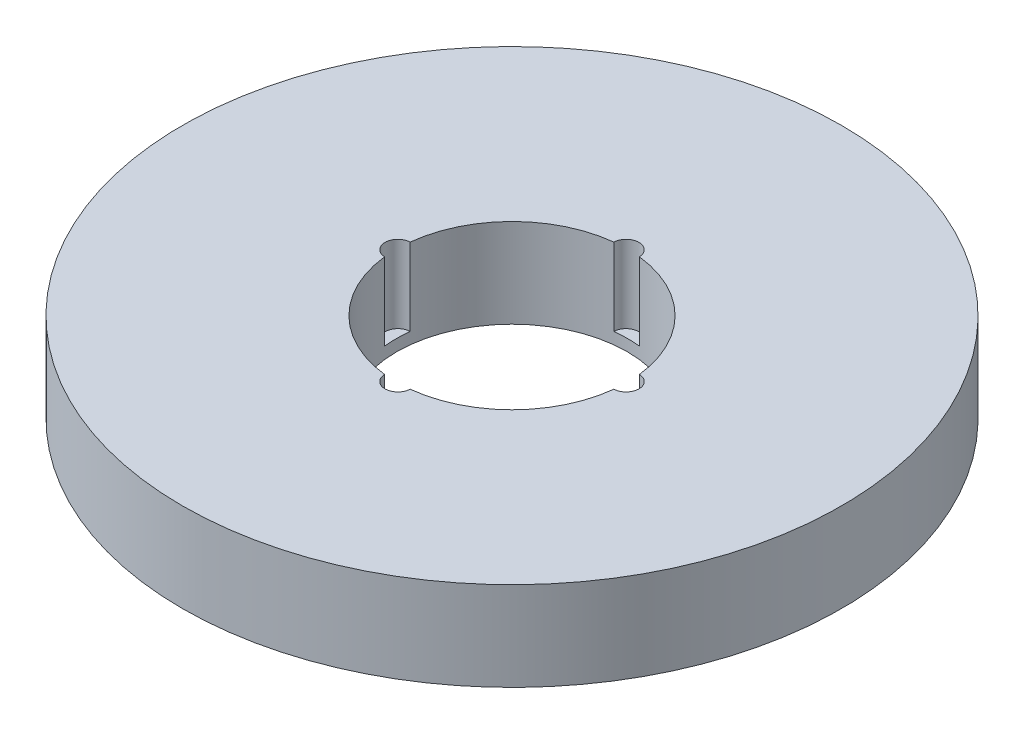
ISO-10303-21;
HEADER;
FILE_DESCRIPTION(('STEP AP214'),'2;1');
FILE_NAME('part.step','',(''),(''),'','','');
FILE_SCHEMA(('AUTOMOTIVE_DESIGN { 1 0 10303 214 1 1 1 1 }'));
ENDSEC;
DATA;
#1=APPLICATION_CONTEXT('core data for automotive mechanical design processes');
#2=APPLICATION_PROTOCOL_DEFINITION('international standard','automotive_design',2000,#1);
#3=PRODUCT_CONTEXT('',#1,'mechanical');
#4=PRODUCT('Part','Part','',(#3));
#5=PRODUCT_RELATED_PRODUCT_CATEGORY('part','',(#4));
#6=PRODUCT_DEFINITION_FORMATION('','',#4);
#7=PRODUCT_DEFINITION_CONTEXT('part definition',#1,'design');
#8=PRODUCT_DEFINITION('design','',#6,#7);
#9=PRODUCT_DEFINITION_SHAPE('','',#8);
#10=(LENGTH_UNIT() NAMED_UNIT(*) SI_UNIT(.MILLI.,.METRE.));
#11=(NAMED_UNIT(*) PLANE_ANGLE_UNIT() SI_UNIT($,.RADIAN.));
#12=(NAMED_UNIT(*) SI_UNIT($,.STERADIAN.) SOLID_ANGLE_UNIT());
#13=UNCERTAINTY_MEASURE_WITH_UNIT(LENGTH_MEASURE(1.E-05),#10,'distance_accuracy_value','');
#14=(GEOMETRIC_REPRESENTATION_CONTEXT(3) GLOBAL_UNCERTAINTY_ASSIGNED_CONTEXT((#13)) GLOBAL_UNIT_ASSIGNED_CONTEXT((#10,
#11,#12)) REPRESENTATION_CONTEXT('',''));
#15=CARTESIAN_POINT('',(0.,0.,0.));
#16=DIRECTION('',(0.,0.,1.));
#17=DIRECTION('',(1.,0.,0.));
#18=AXIS2_PLACEMENT_3D('',#15,#16,#17);
#19=CARTESIAN_POINT('',(0.,27.,0.));
#20=DIRECTION('',(0.,-1.,0.));
#21=DIRECTION('',(0.,0.,-1.));
#22=AXIS2_PLACEMENT_3D('',#19,#20,#21);
#23=CYLINDRICAL_SURFACE('',#22,100.);
#24=CARTESIAN_POINT('',(0.,27.,0.));
#25=DIRECTION('',(0.,1.,0.));
#26=DIRECTION('',(0.,0.,1.));
#27=AXIS2_PLACEMENT_3D('',#24,#25,#26);
#28=CIRCLE('',#27,100.);
#29=CARTESIAN_POINT('',(0.,27.,100.));
#30=VERTEX_POINT('',#29);
#31=EDGE_CURVE('E148',#30,#30,#28,.T.);
#32=ORIENTED_EDGE('',*,*,#31,.F.);
#33=EDGE_LOOP('',(#32));
#34=FACE_BOUND('',#33,.T.);
#35=CARTESIAN_POINT('',(0.,0.,0.));
#36=DIRECTION('',(0.,1.,0.));
#37=DIRECTION('',(0.,0.,1.));
#38=AXIS2_PLACEMENT_3D('',#35,#36,#37);
#39=CIRCLE('',#38,100.);
#40=CARTESIAN_POINT('',(0.,0.,100.));
#41=VERTEX_POINT('',#40);
#42=EDGE_CURVE('E139',#41,#41,#39,.T.);
#43=ORIENTED_EDGE('',*,*,#42,.T.);
#44=EDGE_LOOP('',(#43));
#45=FACE_BOUND('',#44,.T.);
#46=ADVANCED_FACE('F39',(#34,#45),#23,.T.);
#47=CARTESIAN_POINT('',(0.,27.,0.));
#48=DIRECTION('',(0.,1.,0.));
#49=DIRECTION('',(0.,0.,1.));
#50=AXIS2_PLACEMENT_3D('',#47,#48,#49);
#51=PLANE('',#50);
#52=CARTESIAN_POINT('',(1.20958514868444E-13,27.,34.6438955645464));
#53=DIRECTION('',(0.,1.,0.));
#54=DIRECTION('',(1.,0.,0.));
#55=AXIS2_PLACEMENT_3D('',#52,#53,#54);
#56=CIRCLE('',#55,3.8728173395284);
#57=CARTESIAN_POINT('',(-3.87023278960007,27.,34.7853603999485));
#58=VERTEX_POINT('',#57);
#59=CARTESIAN_POINT('',(3.87023278960032,27.,34.7853603999485));
#60=VERTEX_POINT('',#59);
#61=EDGE_CURVE('E175',#58,#60,#56,.T.);
#62=ORIENTED_EDGE('',*,*,#61,.F.);
#63=CARTESIAN_POINT('',(0.,27.,0.));
#64=DIRECTION('',(0.,1.,0.));
#65=DIRECTION('',(0.,0.,1.));
#66=AXIS2_PLACEMENT_3D('',#63,#64,#65);
#67=CIRCLE('',#66,35.);
#68=CARTESIAN_POINT('',(-34.7853603999485,27.,3.87023278960019));
#69=VERTEX_POINT('',#68);
#70=EDGE_CURVE('E134',#69,#58,#67,.T.);
#71=ORIENTED_EDGE('',*,*,#70,.F.);
#72=CARTESIAN_POINT('',(-34.6438955645464,27.,0.));
#73=DIRECTION('',(0.,1.,0.));
#74=DIRECTION('',(0.,0.,1.));
#75=AXIS2_PLACEMENT_3D('',#72,#73,#74);
#76=CIRCLE('',#75,3.8728173395284);
#77=CARTESIAN_POINT('',(-34.7853603999485,27.,-3.87023278960019));
#78=VERTEX_POINT('',#77);
#79=EDGE_CURVE('E143',#78,#69,#76,.T.);
#80=ORIENTED_EDGE('',*,*,#79,.F.);
#81=CARTESIAN_POINT('',(-3.87023278960056,27.,-34.7853603999484));
#82=VERTEX_POINT('',#81);
#83=EDGE_CURVE('E123',#82,#78,#67,.T.);
#84=ORIENTED_EDGE('',*,*,#83,.F.);
#85=CARTESIAN_POINT('',(-3.62875544605333E-13,27.,-34.6438955645464));
#86=DIRECTION('',(0.,1.,0.));
#87=DIRECTION('',(-1.,0.,0.));
#88=AXIS2_PLACEMENT_3D('',#85,#86,#87);
#89=CIRCLE('',#88,3.8728173395284);
#90=CARTESIAN_POINT('',(3.87023278959983,27.,-34.7853603999485));
#91=VERTEX_POINT('',#90);
#92=EDGE_CURVE('E106',#91,#82,#89,.T.);
#93=ORIENTED_EDGE('',*,*,#92,.F.);
#94=CARTESIAN_POINT('',(34.7853603999485,27.,-3.87023278960019));
#95=VERTEX_POINT('',#94);
#96=EDGE_CURVE('E125',#95,#91,#67,.T.);
#97=ORIENTED_EDGE('',*,*,#96,.F.);
#98=CARTESIAN_POINT('',(34.6438955645464,27.,0.));
#99=DIRECTION('',(0.,1.,0.));
#100=DIRECTION('',(0.,0.,-1.));
#101=AXIS2_PLACEMENT_3D('',#98,#99,#100);
#102=CIRCLE('',#101,3.8728173395284);
#103=CARTESIAN_POINT('',(34.7853603999485,27.,3.87023278960019));
#104=VERTEX_POINT('',#103);
#105=EDGE_CURVE('E286',#104,#95,#102,.T.);
#106=ORIENTED_EDGE('',*,*,#105,.F.);
#107=EDGE_CURVE('E135',#60,#104,#67,.T.);
#108=ORIENTED_EDGE('',*,*,#107,.F.);
#109=EDGE_LOOP('',(#62,#71,#80,#84,#93,#97,#106,#108));
#110=FACE_BOUND('',#109,.T.);
#111=ORIENTED_EDGE('',*,*,#31,.T.);
#112=EDGE_LOOP('',(#111));
#113=FACE_BOUND('',#112,.T.);
#114=ADVANCED_FACE('F118',(#110,#113),#51,.T.);
#115=CARTESIAN_POINT('',(0.,0.,0.));
#116=DIRECTION('',(0.,1.,0.));
#117=DIRECTION('',(0.,0.,1.));
#118=AXIS2_PLACEMENT_3D('',#115,#116,#117);
#119=PLANE('',#118);
#120=CARTESIAN_POINT('',(0.,0.,0.));
#121=DIRECTION('',(0.,1.,0.));
#122=DIRECTION('',(0.,0.,1.));
#123=AXIS2_PLACEMENT_3D('',#120,#121,#122);
#124=CIRCLE('',#123,35.);
#125=CARTESIAN_POINT('',(0.,0.,35.));
#126=VERTEX_POINT('',#125);
#127=EDGE_CURVE('E136',#126,#126,#124,.T.);
#128=ORIENTED_EDGE('',*,*,#127,.T.);
#129=EDGE_LOOP('',(#128));
#130=FACE_BOUND('',#129,.T.);
#131=ORIENTED_EDGE('',*,*,#42,.F.);
#132=EDGE_LOOP('',(#131));
#133=FACE_BOUND('',#132,.T.);
#134=ADVANCED_FACE('F187',(#130,#133),#119,.F.);
#135=CARTESIAN_POINT('',(0.,27.,0.));
#136=DIRECTION('',(0.,-1.,0.));
#137=DIRECTION('',(0.,0.,-1.));
#138=AXIS2_PLACEMENT_3D('',#135,#136,#137);
#139=CYLINDRICAL_SURFACE('',#138,35.);
#140=DIRECTION('',(0.,1.,0.));
#141=VECTOR('',#140,1.);
#142=CARTESIAN_POINT('',(-3.87023278960007,15.2589677289112,34.7853603999485));
#143=LINE('',#142,#141);
#144=CARTESIAN_POINT('',(-3.87023278960007,3.51793545782236,34.7853603999485));
#145=VERTEX_POINT('',#144);
#146=EDGE_CURVE('E11',#145,#58,#143,.T.);
#147=ORIENTED_EDGE('',*,*,#146,.F.);
#148=CARTESIAN_POINT('',(0.,3.51793545782236,0.));
#149=DIRECTION('',(0.,1.,0.));
#150=DIRECTION('',(0.,0.,1.));
#151=AXIS2_PLACEMENT_3D('',#148,#149,#150);
#152=CIRCLE('',#151,35.);
#153=CARTESIAN_POINT('',(3.87023278960032,3.51793545782236,34.7853603999485));
#154=VERTEX_POINT('',#153);
#155=EDGE_CURVE('E170',#145,#154,#152,.T.);
#156=ORIENTED_EDGE('',*,*,#155,.T.);
#157=DIRECTION('',(0.,1.,0.));
#158=VECTOR('',#157,1.);
#159=CARTESIAN_POINT('',(3.87023278960031,15.2589677289112,34.7853603999485));
#160=LINE('',#159,#158);
#161=EDGE_CURVE('E46',#60,#154,#160,.F.);
#162=ORIENTED_EDGE('',*,*,#161,.F.);
#163=ORIENTED_EDGE('',*,*,#107,.T.);
#164=DIRECTION('',(0.,1.,0.));
#165=VECTOR('',#164,1.);
#166=CARTESIAN_POINT('',(34.7853603999485,15.2589677289112,3.87023278960019));
#167=LINE('',#166,#165);
#168=CARTESIAN_POINT('',(34.7853603999485,3.51793545782236,3.87023278960019));
#169=VERTEX_POINT('',#168);
#170=EDGE_CURVE('E164',#169,#104,#167,.T.);
#171=ORIENTED_EDGE('',*,*,#170,.F.);
#172=CARTESIAN_POINT('',(0.,3.51793545782236,0.));
#173=DIRECTION('',(0.,1.,0.));
#174=DIRECTION('',(0.,0.,1.));
#175=AXIS2_PLACEMENT_3D('',#172,#173,#174);
#176=CIRCLE('',#175,35.);
#177=CARTESIAN_POINT('',(34.7853603999485,3.51793545782236,-3.87023278960019));
#178=VERTEX_POINT('',#177);
#179=EDGE_CURVE('E115',#169,#178,#176,.T.);
#180=ORIENTED_EDGE('',*,*,#179,.T.);
#181=DIRECTION('',(0.,1.,0.));
#182=VECTOR('',#181,1.);
#183=CARTESIAN_POINT('',(34.7853603999485,15.2589677289112,-3.87023278960019));
#184=LINE('',#183,#182);
#185=EDGE_CURVE('E131',#95,#178,#184,.F.);
#186=ORIENTED_EDGE('',*,*,#185,.F.);
#187=ORIENTED_EDGE('',*,*,#96,.T.);
#188=DIRECTION('',(0.,1.,0.));
#189=VECTOR('',#188,1.);
#190=CARTESIAN_POINT('',(3.87023278959983,15.2589677289112,-34.7853603999485));
#191=LINE('',#190,#189);
#192=CARTESIAN_POINT('',(3.87023278959983,3.51793545782236,-34.7853603999485));
#193=VERTEX_POINT('',#192);
#194=EDGE_CURVE('E105',#193,#91,#191,.T.);
#195=ORIENTED_EDGE('',*,*,#194,.F.);
#196=CARTESIAN_POINT('',(0.,3.51793545782236,0.));
#197=DIRECTION('',(0.,1.,0.));
#198=DIRECTION('',(0.,0.,1.));
#199=AXIS2_PLACEMENT_3D('',#196,#197,#198);
#200=CIRCLE('',#199,35.);
#201=CARTESIAN_POINT('',(-3.87023278960056,3.51793545782236,-34.7853603999484));
#202=VERTEX_POINT('',#201);
#203=EDGE_CURVE('E159',#193,#202,#200,.T.);
#204=ORIENTED_EDGE('',*,*,#203,.T.);
#205=DIRECTION('',(0.,1.,0.));
#206=VECTOR('',#205,1.);
#207=CARTESIAN_POINT('',(-3.87023278960056,15.2589677289112,-34.7853603999485));
#208=LINE('',#207,#206);
#209=EDGE_CURVE('E114',#82,#202,#208,.F.);
#210=ORIENTED_EDGE('',*,*,#209,.F.);
#211=ORIENTED_EDGE('',*,*,#83,.T.);
#212=DIRECTION('',(0.,1.,0.));
#213=VECTOR('',#212,1.);
#214=CARTESIAN_POINT('',(-34.7853603999485,15.2589677289112,-3.87023278960019));
#215=LINE('',#214,#213);
#216=CARTESIAN_POINT('',(-34.7853603999485,3.51793545782236,-3.87023278960019));
#217=VERTEX_POINT('',#216);
#218=EDGE_CURVE('E160',#217,#78,#215,.T.);
#219=ORIENTED_EDGE('',*,*,#218,.F.);
#220=CARTESIAN_POINT('',(0.,3.51793545782236,0.));
#221=DIRECTION('',(0.,1.,0.));
#222=DIRECTION('',(0.,0.,1.));
#223=AXIS2_PLACEMENT_3D('',#220,#221,#222);
#224=CIRCLE('',#223,35.);
#225=CARTESIAN_POINT('',(-34.7853603999485,3.51793545782236,3.87023278960019));
#226=VERTEX_POINT('',#225);
#227=EDGE_CURVE('E149',#217,#226,#224,.T.);
#228=ORIENTED_EDGE('',*,*,#227,.T.);
#229=DIRECTION('',(0.,1.,0.));
#230=VECTOR('',#229,1.);
#231=CARTESIAN_POINT('',(-34.7853603999485,15.2589677289112,3.87023278960019));
#232=LINE('',#231,#230);
#233=EDGE_CURVE('E152',#69,#226,#232,.F.);
#234=ORIENTED_EDGE('',*,*,#233,.F.);
#235=ORIENTED_EDGE('',*,*,#70,.T.);
#236=EDGE_LOOP('',(#147,#156,#162,#163,#171,#180,#186,#187,#195,#204,#210,#211,#219,#228,#234,#235));
#237=FACE_BOUND('',#236,.T.);
#238=ORIENTED_EDGE('',*,*,#127,.F.);
#239=EDGE_LOOP('',(#238));
#240=FACE_BOUND('',#239,.T.);
#241=ADVANCED_FACE('F126',(#237,#240),#139,.F.);
#242=CARTESIAN_POINT('',(-34.6438955645464,3.51793545782236,0.));
#243=DIRECTION('',(0.,1.,0.));
#244=DIRECTION('',(0.,0.,1.));
#245=AXIS2_PLACEMENT_3D('',#242,#243,#244);
#246=CYLINDRICAL_SURFACE('',#245,3.8728173395284);
#247=ORIENTED_EDGE('',*,*,#218,.T.);
#248=ORIENTED_EDGE('',*,*,#79,.T.);
#249=ORIENTED_EDGE('',*,*,#233,.T.);
#250=CARTESIAN_POINT('',(-34.6438955645464,3.51793545782236,0.));
#251=DIRECTION('',(0.,1.,0.));
#252=DIRECTION('',(0.,0.,1.));
#253=AXIS2_PLACEMENT_3D('',#250,#251,#252);
#254=CIRCLE('',#253,3.8728173395284);
#255=EDGE_CURVE('E144',#217,#226,#254,.T.);
#256=ORIENTED_EDGE('',*,*,#255,.F.);
#257=EDGE_LOOP('',(#247,#248,#249,#256));
#258=FACE_BOUND('',#257,.T.);
#259=ADVANCED_FACE('F200',(#258),#246,.F.);
#260=CARTESIAN_POINT('',(-34.6438955645464,3.51793545782236,0.));
#261=DIRECTION('',(0.,1.,0.));
#262=DIRECTION('',(0.,0.,1.));
#263=AXIS2_PLACEMENT_3D('',#260,#261,#262);
#264=PLANE('',#263);
#265=ORIENTED_EDGE('',*,*,#255,.T.);
#266=ORIENTED_EDGE('',*,*,#227,.F.);
#267=EDGE_LOOP('',(#265,#266));
#268=FACE_BOUND('',#267,.T.);
#269=ADVANCED_FACE('F201',(#268),#264,.T.);
#270=CARTESIAN_POINT('',(-3.62875544605333E-13,3.51793545782236,-34.6438955645464));
#271=DIRECTION('',(0.,1.,0.));
#272=DIRECTION('',(0.,0.,1.));
#273=AXIS2_PLACEMENT_3D('',#270,#271,#272);
#274=CYLINDRICAL_SURFACE('',#273,3.8728173395284);
#275=ORIENTED_EDGE('',*,*,#194,.T.);
#276=ORIENTED_EDGE('',*,*,#92,.T.);
#277=ORIENTED_EDGE('',*,*,#209,.T.);
#278=CARTESIAN_POINT('',(-3.62875544605333E-13,3.51793545782236,-34.6438955645464));
#279=DIRECTION('',(0.,1.,0.));
#280=DIRECTION('',(-1.,0.,0.));
#281=AXIS2_PLACEMENT_3D('',#278,#279,#280);
#282=CIRCLE('',#281,3.8728173395284);
#283=EDGE_CURVE('E107',#193,#202,#282,.T.);
#284=ORIENTED_EDGE('',*,*,#283,.F.);
#285=EDGE_LOOP('',(#275,#276,#277,#284));
#286=FACE_BOUND('',#285,.T.);
#287=ADVANCED_FACE('F102',(#286),#274,.F.);
#288=CARTESIAN_POINT('',(-3.62875544605333E-13,3.51793545782236,-34.6438955645464));
#289=DIRECTION('',(0.,1.,0.));
#290=DIRECTION('',(-1.,0.,0.));
#291=AXIS2_PLACEMENT_3D('',#288,#289,#290);
#292=PLANE('',#291);
#293=ORIENTED_EDGE('',*,*,#283,.T.);
#294=ORIENTED_EDGE('',*,*,#203,.F.);
#295=EDGE_LOOP('',(#293,#294));
#296=FACE_BOUND('',#295,.T.);
#297=ADVANCED_FACE('F209',(#296),#292,.T.);
#298=CARTESIAN_POINT('',(34.6438955645464,3.51793545782236,0.));
#299=DIRECTION('',(0.,1.,0.));
#300=DIRECTION('',(0.,0.,1.));
#301=AXIS2_PLACEMENT_3D('',#298,#299,#300);
#302=CYLINDRICAL_SURFACE('',#301,3.8728173395284);
#303=ORIENTED_EDGE('',*,*,#170,.T.);
#304=ORIENTED_EDGE('',*,*,#105,.T.);
#305=ORIENTED_EDGE('',*,*,#185,.T.);
#306=CARTESIAN_POINT('',(34.6438955645464,3.51793545782236,0.));
#307=DIRECTION('',(0.,1.,0.));
#308=DIRECTION('',(0.,0.,-1.));
#309=AXIS2_PLACEMENT_3D('',#306,#307,#308);
#310=CIRCLE('',#309,3.8728173395284);
#311=EDGE_CURVE('E56',#169,#178,#310,.T.);
#312=ORIENTED_EDGE('',*,*,#311,.F.);
#313=EDGE_LOOP('',(#303,#304,#305,#312));
#314=FACE_BOUND('',#313,.T.);
#315=ADVANCED_FACE('F213',(#314),#302,.F.);
#316=CARTESIAN_POINT('',(34.6438955645464,3.51793545782236,0.));
#317=DIRECTION('',(0.,1.,0.));
#318=DIRECTION('',(0.,0.,-1.));
#319=AXIS2_PLACEMENT_3D('',#316,#317,#318);
#320=PLANE('',#319);
#321=ORIENTED_EDGE('',*,*,#311,.T.);
#322=ORIENTED_EDGE('',*,*,#179,.F.);
#323=EDGE_LOOP('',(#321,#322));
#324=FACE_BOUND('',#323,.T.);
#325=ADVANCED_FACE('F179',(#324),#320,.T.);
#326=CARTESIAN_POINT('',(1.20958514868444E-13,3.51793545782236,34.6438955645464));
#327=DIRECTION('',(0.,1.,0.));
#328=DIRECTION('',(0.,0.,1.));
#329=AXIS2_PLACEMENT_3D('',#326,#327,#328);
#330=CYLINDRICAL_SURFACE('',#329,3.8728173395284);
#331=ORIENTED_EDGE('',*,*,#146,.T.);
#332=ORIENTED_EDGE('',*,*,#61,.T.);
#333=ORIENTED_EDGE('',*,*,#161,.T.);
#334=CARTESIAN_POINT('',(1.20958514868444E-13,3.51793545782236,34.6438955645464));
#335=DIRECTION('',(0.,1.,0.));
#336=DIRECTION('',(1.,0.,0.));
#337=AXIS2_PLACEMENT_3D('',#334,#335,#336);
#338=CIRCLE('',#337,3.8728173395284);
#339=EDGE_CURVE('E55',#145,#154,#338,.T.);
#340=ORIENTED_EDGE('',*,*,#339,.F.);
#341=EDGE_LOOP('',(#331,#332,#333,#340));
#342=FACE_BOUND('',#341,.T.);
#343=ADVANCED_FACE('F171',(#342),#330,.F.);
#344=CARTESIAN_POINT('',(1.20958514868444E-13,3.51793545782236,34.6438955645464));
#345=DIRECTION('',(0.,1.,0.));
#346=DIRECTION('',(1.,0.,0.));
#347=AXIS2_PLACEMENT_3D('',#344,#345,#346);
#348=PLANE('',#347);
#349=ORIENTED_EDGE('',*,*,#339,.T.);
#350=ORIENTED_EDGE('',*,*,#155,.F.);
#351=EDGE_LOOP('',(#349,#350));
#352=FACE_BOUND('',#351,.T.);
#353=ADVANCED_FACE('F173',(#352),#348,.T.);
#354=CLOSED_SHELL('',(#46,#114,#134,#241,#259,#269,#287,#297,#315,#325,#343,#353));
#355=MANIFOLD_SOLID_BREP('B2',#354);
#356=ADVANCED_BREP_SHAPE_REPRESENTATION('',(#18,#355),#14);
#357=SHAPE_DEFINITION_REPRESENTATION(#9,#356);
ENDSEC;
END-ISO-10303-21;
